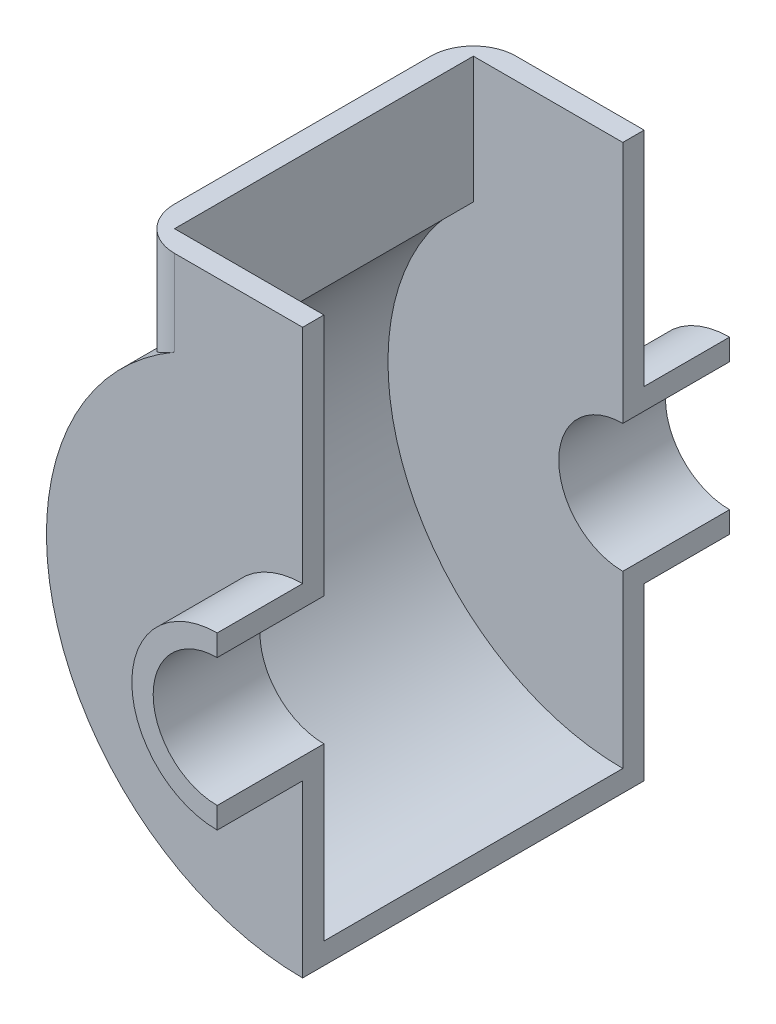
ISO-10303-21;
HEADER;
FILE_DESCRIPTION(('STEP AP214'),'2;1');
FILE_NAME('part.step','',(''),(''),'','','');
FILE_SCHEMA(('AUTOMOTIVE_DESIGN { 1 0 10303 214 1 1 1 1 }'));
ENDSEC;
DATA;
#1=APPLICATION_CONTEXT('core data for automotive mechanical design processes');
#2=APPLICATION_PROTOCOL_DEFINITION('international standard','automotive_design',2000,#1);
#3=PRODUCT_CONTEXT('',#1,'mechanical');
#4=PRODUCT('Part','Part','',(#3));
#5=PRODUCT_RELATED_PRODUCT_CATEGORY('part','',(#4));
#6=PRODUCT_DEFINITION_FORMATION('','',#4);
#7=PRODUCT_DEFINITION_CONTEXT('part definition',#1,'design');
#8=PRODUCT_DEFINITION('design','',#6,#7);
#9=PRODUCT_DEFINITION_SHAPE('','',#8);
#10=(LENGTH_UNIT() NAMED_UNIT(*) SI_UNIT(.MILLI.,.METRE.));
#11=(NAMED_UNIT(*) PLANE_ANGLE_UNIT() SI_UNIT($,.RADIAN.));
#12=(NAMED_UNIT(*) SI_UNIT($,.STERADIAN.) SOLID_ANGLE_UNIT());
#13=UNCERTAINTY_MEASURE_WITH_UNIT(LENGTH_MEASURE(1.E-05),#10,'distance_accuracy_value','');
#14=(GEOMETRIC_REPRESENTATION_CONTEXT(3) GLOBAL_UNCERTAINTY_ASSIGNED_CONTEXT((#13)) GLOBAL_UNIT_ASSIGNED_CONTEXT((#10,
#11,#12)) REPRESENTATION_CONTEXT('',''));
#15=CARTESIAN_POINT('',(0.,0.,0.));
#16=DIRECTION('',(0.,0.,1.));
#17=DIRECTION('',(1.,0.,0.));
#18=AXIS2_PLACEMENT_3D('',#15,#16,#17);
#19=CARTESIAN_POINT('',(0.,0.,0.));
#20=DIRECTION('',(0.,0.,1.));
#21=DIRECTION('',(1.,0.,0.));
#22=AXIS2_PLACEMENT_3D('',#19,#20,#21);
#23=PLANE('',#22);
#24=CARTESIAN_POINT('',(0.,0.,0.));
#25=DIRECTION('',(0.,0.,1.));
#26=DIRECTION('',(1.,0.,0.));
#27=AXIS2_PLACEMENT_3D('',#24,#25,#26);
#28=CIRCLE('',#27,55.);
#29=CARTESIAN_POINT('',(-35.,42.4264068711929,0.));
#30=VERTEX_POINT('',#29);
#31=CARTESIAN_POINT('',(0.,-55.,0.));
#32=VERTEX_POINT('',#31);
#33=EDGE_CURVE('E227',#30,#32,#28,.T.);
#34=ORIENTED_EDGE('',*,*,#33,.F.);
#35=DIRECTION('',(0.,-1.,0.));
#36=VECTOR('',#35,1.);
#37=CARTESIAN_POINT('',(-35.,72.,0.));
#38=LINE('',#37,#36);
#39=CARTESIAN_POINT('',(-35.,72.,0.));
#40=VERTEX_POINT('',#39);
#41=EDGE_CURVE('E231',#40,#30,#38,.T.);
#42=ORIENTED_EDGE('',*,*,#41,.F.);
#43=DIRECTION('',(-1.,0.,0.));
#44=VECTOR('',#43,1.);
#45=CARTESIAN_POINT('',(0.,72.,0.));
#46=LINE('',#45,#44);
#47=CARTESIAN_POINT('',(0.,72.,0.));
#48=VERTEX_POINT('',#47);
#49=EDGE_CURVE('E230',#48,#40,#46,.T.);
#50=ORIENTED_EDGE('',*,*,#49,.F.);
#51=DIRECTION('',(0.,1.,0.));
#52=VECTOR('',#51,1.);
#53=CARTESIAN_POINT('',(0.,20.,0.));
#54=LINE('',#53,#52);
#55=CARTESIAN_POINT('',(0.,15.,0.));
#56=VERTEX_POINT('',#55);
#57=EDGE_CURVE('E286',#56,#48,#54,.T.);
#58=ORIENTED_EDGE('',*,*,#57,.F.);
#59=CARTESIAN_POINT('',(0.,0.,0.));
#60=DIRECTION('',(0.,0.,-1.));
#61=DIRECTION('',(1.,0.,0.));
#62=AXIS2_PLACEMENT_3D('',#59,#60,#61);
#63=CIRCLE('',#62,15.);
#64=CARTESIAN_POINT('',(0.,-15.,0.));
#65=VERTEX_POINT('',#64);
#66=EDGE_CURVE('E272',#65,#56,#63,.T.);
#67=ORIENTED_EDGE('',*,*,#66,.F.);
#68=DIRECTION('',(0.,1.,0.));
#69=VECTOR('',#68,1.);
#70=CARTESIAN_POINT('',(0.,-15.,0.));
#71=LINE('',#70,#69);
#72=EDGE_CURVE('E277',#32,#65,#71,.T.);
#73=ORIENTED_EDGE('',*,*,#72,.F.);
#74=EDGE_LOOP('',(#34,#42,#50,#58,#67,#73));
#75=FACE_BOUND('',#74,.T.);
#76=ADVANCED_FACE('F33',(#75),#23,.F.);
#77=CARTESIAN_POINT('',(0.,0.,25.));
#78=DIRECTION('',(0.,0.,-1.));
#79=DIRECTION('',(-1.,0.,0.));
#80=AXIS2_PLACEMENT_3D('',#77,#78,#79);
#81=CYLINDRICAL_SURFACE('',#80,15.);
#82=ORIENTED_EDGE('',*,*,#66,.T.);
#83=DIRECTION('',(0.,0.,-1.));
#84=VECTOR('',#83,1.);
#85=CARTESIAN_POINT('',(0.,15.,25.));
#86=LINE('',#85,#84);
#87=CARTESIAN_POINT('',(0.,15.,25.));
#88=VERTEX_POINT('',#87);
#89=EDGE_CURVE('E296',#88,#56,#86,.T.);
#90=ORIENTED_EDGE('',*,*,#89,.F.);
#91=CARTESIAN_POINT('',(0.,0.,25.));
#92=DIRECTION('',(0.,0.,-1.));
#93=DIRECTION('',(1.,0.,0.));
#94=AXIS2_PLACEMENT_3D('',#91,#92,#93);
#95=CIRCLE('',#94,15.);
#96=CARTESIAN_POINT('',(0.,-15.,25.));
#97=VERTEX_POINT('',#96);
#98=EDGE_CURVE('E273',#97,#88,#95,.T.);
#99=ORIENTED_EDGE('',*,*,#98,.F.);
#100=DIRECTION('',(0.,0.,-1.));
#101=VECTOR('',#100,1.);
#102=CARTESIAN_POINT('',(0.,-15.,25.));
#103=LINE('',#102,#101);
#104=EDGE_CURVE('E283',#97,#65,#103,.T.);
#105=ORIENTED_EDGE('',*,*,#104,.T.);
#106=EDGE_LOOP('',(#82,#90,#99,#105));
#107=FACE_BOUND('',#106,.T.);
#108=ADVANCED_FACE('F324',(#107),#81,.F.);
#109=CARTESIAN_POINT('',(0.,20.,25.));
#110=DIRECTION('',(-1.,0.,0.));
#111=DIRECTION('',(0.,0.,1.));
#112=AXIS2_PLACEMENT_3D('',#109,#110,#111);
#113=PLANE('',#112);
#114=ORIENTED_EDGE('',*,*,#57,.T.);
#115=DIRECTION('',(0.,0.,-1.));
#116=VECTOR('',#115,1.);
#117=CARTESIAN_POINT('',(0.,72.,5.));
#118=LINE('',#117,#116);
#119=CARTESIAN_POINT('',(0.,72.,5.));
#120=VERTEX_POINT('',#119);
#121=EDGE_CURVE('E269',#120,#48,#118,.T.);
#122=ORIENTED_EDGE('',*,*,#121,.F.);
#123=DIRECTION('',(0.,1.,0.));
#124=VECTOR('',#123,1.);
#125=CARTESIAN_POINT('',(0.,20.,5.));
#126=LINE('',#125,#124);
#127=CARTESIAN_POINT('',(0.,20.,5.));
#128=VERTEX_POINT('',#127);
#129=EDGE_CURVE('E251',#128,#120,#126,.T.);
#130=ORIENTED_EDGE('',*,*,#129,.F.);
#131=DIRECTION('',(0.,0.,-1.));
#132=VECTOR('',#131,1.);
#133=CARTESIAN_POINT('',(0.,20.,25.));
#134=LINE('',#133,#132);
#135=CARTESIAN_POINT('',(0.,20.,25.));
#136=VERTEX_POINT('',#135);
#137=EDGE_CURVE('E294',#136,#128,#134,.T.);
#138=ORIENTED_EDGE('',*,*,#137,.F.);
#139=DIRECTION('',(0.,1.,0.));
#140=VECTOR('',#139,1.);
#141=CARTESIAN_POINT('',(0.,20.,25.));
#142=LINE('',#141,#140);
#143=EDGE_CURVE('E276',#88,#136,#142,.T.);
#144=ORIENTED_EDGE('',*,*,#143,.F.);
#145=ORIENTED_EDGE('',*,*,#89,.T.);
#146=EDGE_LOOP('',(#114,#122,#130,#138,#144,#145));
#147=FACE_BOUND('',#146,.T.);
#148=ADVANCED_FACE('F327',(#147),#113,.F.);
#149=CARTESIAN_POINT('',(0.,0.,25.));
#150=DIRECTION('',(0.,0.,-1.));
#151=DIRECTION('',(-1.,0.,0.));
#152=AXIS2_PLACEMENT_3D('',#149,#150,#151);
#153=CYLINDRICAL_SURFACE('',#152,20.);
#154=ORIENTED_EDGE('',*,*,#137,.T.);
#155=CARTESIAN_POINT('',(0.,0.,5.));
#156=DIRECTION('',(0.,0.,-1.));
#157=DIRECTION('',(1.,0.,0.));
#158=AXIS2_PLACEMENT_3D('',#155,#156,#157);
#159=CIRCLE('',#158,20.);
#160=CARTESIAN_POINT('',(0.,-20.,5.));
#161=VERTEX_POINT('',#160);
#162=EDGE_CURVE('E248',#161,#128,#159,.T.);
#163=ORIENTED_EDGE('',*,*,#162,.F.);
#164=DIRECTION('',(0.,0.,-1.));
#165=VECTOR('',#164,1.);
#166=CARTESIAN_POINT('',(0.,-20.,25.));
#167=LINE('',#166,#165);
#168=CARTESIAN_POINT('',(0.,-20.,25.));
#169=VERTEX_POINT('',#168);
#170=EDGE_CURVE('E291',#169,#161,#167,.T.);
#171=ORIENTED_EDGE('',*,*,#170,.F.);
#172=CARTESIAN_POINT('',(0.,0.,25.));
#173=DIRECTION('',(0.,0.,1.));
#174=DIRECTION('',(-1.,0.,0.));
#175=AXIS2_PLACEMENT_3D('',#172,#173,#174);
#176=CIRCLE('',#175,20.);
#177=EDGE_CURVE('E279',#136,#169,#176,.T.);
#178=ORIENTED_EDGE('',*,*,#177,.F.);
#179=EDGE_LOOP('',(#154,#163,#171,#178));
#180=FACE_BOUND('',#179,.T.);
#181=ADVANCED_FACE('F331',(#180),#153,.T.);
#182=CARTESIAN_POINT('',(0.,-15.,25.));
#183=DIRECTION('',(-1.,0.,0.));
#184=DIRECTION('',(0.,0.,1.));
#185=AXIS2_PLACEMENT_3D('',#182,#183,#184);
#186=PLANE('',#185);
#187=DIRECTION('',(0.,0.,-1.));
#188=VECTOR('',#187,1.);
#189=CARTESIAN_POINT('',(0.,-60.,5.));
#190=LINE('',#189,#188);
#191=CARTESIAN_POINT('',(0.,-60.,5.));
#192=VERTEX_POINT('',#191);
#193=CARTESIAN_POINT('',(0.,-60.,-75.));
#194=VERTEX_POINT('',#193);
#195=EDGE_CURVE('E259',#192,#194,#190,.T.);
#196=ORIENTED_EDGE('',*,*,#195,.T.);
#197=DIRECTION('',(0.,1.,0.));
#198=VECTOR('',#197,1.);
#199=CARTESIAN_POINT('',(0.,-60.,-75.));
#200=LINE('',#199,#198);
#201=CARTESIAN_POINT('',(0.,-20.,-75.));
#202=VERTEX_POINT('',#201);
#203=EDGE_CURVE('E186',#194,#202,#200,.T.);
#204=ORIENTED_EDGE('',*,*,#203,.T.);
#205=DIRECTION('',(0.,0.,1.));
#206=VECTOR('',#205,1.);
#207=CARTESIAN_POINT('',(0.,-20.,-95.));
#208=LINE('',#207,#206);
#209=CARTESIAN_POINT('',(0.,-20.,-95.));
#210=VERTEX_POINT('',#209);
#211=EDGE_CURVE('E219',#210,#202,#208,.T.);
#212=ORIENTED_EDGE('',*,*,#211,.F.);
#213=DIRECTION('',(0.,1.,0.));
#214=VECTOR('',#213,1.);
#215=CARTESIAN_POINT('',(0.,-15.,-95.));
#216=LINE('',#215,#214);
#217=CARTESIAN_POINT('',(0.,-15.,-95.));
#218=VERTEX_POINT('',#217);
#219=EDGE_CURVE('E209',#210,#218,#216,.T.);
#220=ORIENTED_EDGE('',*,*,#219,.T.);
#221=DIRECTION('',(0.,0.,1.));
#222=VECTOR('',#221,1.);
#223=CARTESIAN_POINT('',(0.,-15.,-95.));
#224=LINE('',#223,#222);
#225=CARTESIAN_POINT('',(0.,-15.,-70.));
#226=VERTEX_POINT('',#225);
#227=EDGE_CURVE('E211',#218,#226,#224,.T.);
#228=ORIENTED_EDGE('',*,*,#227,.T.);
#229=DIRECTION('',(0.,1.,0.));
#230=VECTOR('',#229,1.);
#231=CARTESIAN_POINT('',(0.,-15.,-70.));
#232=LINE('',#231,#230);
#233=CARTESIAN_POINT('',(0.,-55.,-70.));
#234=VERTEX_POINT('',#233);
#235=EDGE_CURVE('E204',#234,#226,#232,.T.);
#236=ORIENTED_EDGE('',*,*,#235,.F.);
#237=DIRECTION('',(0.,0.,1.));
#238=VECTOR('',#237,1.);
#239=CARTESIAN_POINT('',(0.,-55.,-95.002));
#240=LINE('',#239,#238);
#241=EDGE_CURVE('E235',#234,#32,#240,.T.);
#242=ORIENTED_EDGE('',*,*,#241,.T.);
#243=ORIENTED_EDGE('',*,*,#72,.T.);
#244=ORIENTED_EDGE('',*,*,#104,.F.);
#245=DIRECTION('',(0.,1.,0.));
#246=VECTOR('',#245,1.);
#247=CARTESIAN_POINT('',(0.,-15.,25.));
#248=LINE('',#247,#246);
#249=EDGE_CURVE('E281',#169,#97,#248,.T.);
#250=ORIENTED_EDGE('',*,*,#249,.F.);
#251=ORIENTED_EDGE('',*,*,#170,.T.);
#252=DIRECTION('',(0.,1.,0.));
#253=VECTOR('',#252,1.);
#254=CARTESIAN_POINT('',(0.,-60.,5.));
#255=LINE('',#254,#253);
#256=EDGE_CURVE('E256',#192,#161,#255,.T.);
#257=ORIENTED_EDGE('',*,*,#256,.F.);
#258=EDGE_LOOP('',(#196,#204,#212,#220,#228,#236,#242,#243,#244,#250,#251,#257));
#259=FACE_BOUND('',#258,.T.);
#260=ADVANCED_FACE('F335',(#259),#186,.F.);
#261=CARTESIAN_POINT('',(0.,0.,25.));
#262=DIRECTION('',(0.,0.,1.));
#263=DIRECTION('',(1.,0.,0.));
#264=AXIS2_PLACEMENT_3D('',#261,#262,#263);
#265=PLANE('',#264);
#266=ORIENTED_EDGE('',*,*,#98,.T.);
#267=ORIENTED_EDGE('',*,*,#143,.T.);
#268=ORIENTED_EDGE('',*,*,#177,.T.);
#269=ORIENTED_EDGE('',*,*,#249,.T.);
#270=EDGE_LOOP('',(#266,#267,#268,#269));
#271=FACE_BOUND('',#270,.T.);
#272=ADVANCED_FACE('F339',(#271),#265,.T.);
#273=CARTESIAN_POINT('',(0.,72.,5.));
#274=DIRECTION('',(0.,-1.,0.));
#275=DIRECTION('',(0.,0.,-1.));
#276=AXIS2_PLACEMENT_3D('',#273,#274,#275);
#277=PLANE('',#276);
#278=DIRECTION('',(-1.,0.,0.));
#279=VECTOR('',#278,1.);
#280=CARTESIAN_POINT('',(0.,72.,-75.));
#281=LINE('',#280,#279);
#282=CARTESIAN_POINT('',(0.,72.,-75.));
#283=VERTEX_POINT('',#282);
#284=CARTESIAN_POINT('',(-30.,72.,-75.));
#285=VERTEX_POINT('',#284);
#286=EDGE_CURVE('E165',#283,#285,#281,.T.);
#287=ORIENTED_EDGE('',*,*,#286,.T.);
#288=CARTESIAN_POINT('',(-30.,72.,-65.));
#289=DIRECTION('',(0.,-1.,0.));
#290=DIRECTION('',(0.,0.,-1.));
#291=AXIS2_PLACEMENT_3D('',#288,#289,#290);
#292=CIRCLE('',#291,10.);
#293=CARTESIAN_POINT('',(-40.,72.,-65.));
#294=VERTEX_POINT('',#293);
#295=EDGE_CURVE('E306',#285,#294,#292,.F.);
#296=ORIENTED_EDGE('',*,*,#295,.T.);
#297=DIRECTION('',(0.,0.,-1.));
#298=VECTOR('',#297,1.);
#299=CARTESIAN_POINT('',(-40.,72.,5.));
#300=LINE('',#299,#298);
#301=CARTESIAN_POINT('',(-40.,72.,-5.));
#302=VERTEX_POINT('',#301);
#303=EDGE_CURVE('E266',#302,#294,#300,.T.);
#304=ORIENTED_EDGE('',*,*,#303,.F.);
#305=CARTESIAN_POINT('',(-30.,72.,-5.));
#306=DIRECTION('',(0.,-1.,0.));
#307=DIRECTION('',(0.,0.,-1.));
#308=AXIS2_PLACEMENT_3D('',#305,#306,#307);
#309=CIRCLE('',#308,10.);
#310=CARTESIAN_POINT('',(-30.,72.,5.));
#311=VERTEX_POINT('',#310);
#312=EDGE_CURVE('E61',#302,#311,#309,.F.);
#313=ORIENTED_EDGE('',*,*,#312,.T.);
#314=DIRECTION('',(-1.,0.,0.));
#315=VECTOR('',#314,1.);
#316=CARTESIAN_POINT('',(0.,72.,5.));
#317=LINE('',#316,#315);
#318=EDGE_CURVE('E253',#120,#311,#317,.T.);
#319=ORIENTED_EDGE('',*,*,#318,.F.);
#320=ORIENTED_EDGE('',*,*,#121,.T.);
#321=ORIENTED_EDGE('',*,*,#49,.T.);
#322=DIRECTION('',(0.,0.,1.));
#323=VECTOR('',#322,1.);
#324=CARTESIAN_POINT('',(-35.,72.,-95.002));
#325=LINE('',#324,#323);
#326=CARTESIAN_POINT('',(-35.,72.,-70.));
#327=VERTEX_POINT('',#326);
#328=EDGE_CURVE('E234',#327,#40,#325,.T.);
#329=ORIENTED_EDGE('',*,*,#328,.F.);
#330=DIRECTION('',(-1.,0.,0.));
#331=VECTOR('',#330,1.);
#332=CARTESIAN_POINT('',(0.,72.,-70.));
#333=LINE('',#332,#331);
#334=CARTESIAN_POINT('',(0.,72.,-70.));
#335=VERTEX_POINT('',#334);
#336=EDGE_CURVE('E182',#335,#327,#333,.T.);
#337=ORIENTED_EDGE('',*,*,#336,.F.);
#338=DIRECTION('',(0.,0.,1.));
#339=VECTOR('',#338,1.);
#340=CARTESIAN_POINT('',(0.,72.,-75.));
#341=LINE('',#340,#339);
#342=EDGE_CURVE('E178',#283,#335,#341,.T.);
#343=ORIENTED_EDGE('',*,*,#342,.F.);
#344=EDGE_LOOP('',(#287,#296,#304,#313,#319,#320,#321,#329,#337,#343));
#345=FACE_BOUND('',#344,.T.);
#346=ADVANCED_FACE('F179',(#345),#277,.F.);
#347=CARTESIAN_POINT('',(-40.,72.,5.));
#348=DIRECTION('',(1.,0.,0.));
#349=DIRECTION('',(0.,1.,0.));
#350=AXIS2_PLACEMENT_3D('',#347,#348,#349);
#351=PLANE('',#350);
#352=ORIENTED_EDGE('',*,*,#303,.T.);
#353=DIRECTION('',(0.,-1.,0.));
#354=VECTOR('',#353,1.);
#355=CARTESIAN_POINT('',(-40.,44.7213595499958,-65.));
#356=LINE('',#355,#354);
#357=CARTESIAN_POINT('',(-40.,44.7213595499958,-65.));
#358=VERTEX_POINT('',#357);
#359=EDGE_CURVE('E301',#294,#358,#356,.T.);
#360=ORIENTED_EDGE('',*,*,#359,.T.);
#361=DIRECTION('',(0.,0.,-1.));
#362=VECTOR('',#361,1.);
#363=CARTESIAN_POINT('',(-40.,44.7213595499958,5.));
#364=LINE('',#363,#362);
#365=CARTESIAN_POINT('',(-40.,44.7213595499958,-5.));
#366=VERTEX_POINT('',#365);
#367=EDGE_CURVE('E263',#366,#358,#364,.T.);
#368=ORIENTED_EDGE('',*,*,#367,.F.);
#369=DIRECTION('',(0.,-1.,0.));
#370=VECTOR('',#369,1.);
#371=CARTESIAN_POINT('',(-40.,72.,-5.));
#372=LINE('',#371,#370);
#373=EDGE_CURVE('E299',#366,#302,#372,.F.);
#374=ORIENTED_EDGE('',*,*,#373,.T.);
#375=EDGE_LOOP('',(#352,#360,#368,#374));
#376=FACE_BOUND('',#375,.T.);
#377=ADVANCED_FACE('F348',(#376),#351,.F.);
#378=CARTESIAN_POINT('',(0.,0.,5.));
#379=DIRECTION('',(0.,0.,-1.));
#380=DIRECTION('',(-1.,0.,0.));
#381=AXIS2_PLACEMENT_3D('',#378,#379,#380);
#382=CYLINDRICAL_SURFACE('',#381,60.);
#383=CARTESIAN_POINT('',(0.,0.,5.));
#384=DIRECTION('',(0.,0.,1.));
#385=DIRECTION('',(1.,0.,0.));
#386=AXIS2_PLACEMENT_3D('',#383,#384,#385);
#387=CIRCLE('',#386,60.);
#388=CARTESIAN_POINT('',(-30.,51.9615242270663,5.));
#389=VERTEX_POINT('',#388);
#390=EDGE_CURVE('E53',#389,#192,#387,.T.);
#391=ORIENTED_EDGE('',*,*,#390,.F.);
#392=CARTESIAN_POINT('',(-30.,51.9615242270663,5.));
#393=CARTESIAN_POINT('',(-30.1846403402756,51.8549243575685,4.99999694467445));
#394=CARTESIAN_POINT('',(-30.3686755821332,51.7473565843307,4.99488587812623));
#395=CARTESIAN_POINT('',(-30.7351668388071,51.5305231450817,4.97462918627216));
#396=CARTESIAN_POINT('',(-30.9176229894396,51.4212576273975,4.95948443281986));
#397=CARTESIAN_POINT('',(-31.4619253243051,51.0913595980358,4.89929167200636));
#398=CARTESIAN_POINT('',(-31.8209014856785,50.868512343648,4.83948477245505));
#399=CARTESIAN_POINT('',(-32.5288887310146,50.418725257113,4.6817684192746));
#400=CARTESIAN_POINT('',(-32.8778736192083,50.1917768316845,4.5837671788936));
#401=CARTESIAN_POINT('',(-33.562476910193,49.7365966241752,4.35090696893926));
#402=CARTESIAN_POINT('',(-33.8980954977703,49.5083648598862,4.21604850911225));
#403=CARTESIAN_POINT('',(-34.5207296024579,49.0759439346811,3.92574534472068));
#404=CARTESIAN_POINT('',(-34.80925125366,48.8716304811259,3.77370267176126));
#405=CARTESIAN_POINT('',(-35.3716903107987,48.4661085573826,3.44107089228342));
#406=CARTESIAN_POINT('',(-35.6456079007732,48.2649000480893,3.26048214561176));
#407=CARTESIAN_POINT('',(-36.1765727574088,47.8682074936152,2.87135112309205));
#408=CARTESIAN_POINT('',(-36.4336405194033,47.6727166603459,2.66284378257166));
#409=CARTESIAN_POINT('',(-36.9290721152615,47.2899728283631,2.21794621899144));
#410=CARTESIAN_POINT('',(-37.167441451851,47.1027174132443,1.98156425075618));
#411=CARTESIAN_POINT('',(-37.565018182153,46.7858596341651,1.54478146403292));
#412=CARTESIAN_POINT('',(-37.7289458526818,46.6537017113221,1.35050833176436));
#413=CARTESIAN_POINT('',(-38.0437650386959,46.3973395734391,0.946710505836684));
#414=CARTESIAN_POINT('',(-38.1946575996422,46.2731347207424,0.737187037795443));
#415=CARTESIAN_POINT('',(-38.4818360085843,46.0345861261904,0.303399948510734));
#416=CARTESIAN_POINT('',(-38.618136880254,45.9202322658759,0.0791518792914311));
#417=CARTESIAN_POINT('',(-38.8746918035924,45.7032445431668,-0.383743447816971));
#418=CARTESIAN_POINT('',(-38.9949492411763,45.6006082084878,-0.622387651960067));
#419=CARTESIAN_POINT('',(-39.1965662504921,45.4273417305266,-1.06669402634215));
#420=CARTESIAN_POINT('',(-39.2809795718102,45.3543309967536,-1.27004581930022));
#421=CARTESIAN_POINT('',(-39.437114382813,45.2186323209964,-1.68488791321455));
#422=CARTESIAN_POINT('',(-39.5088384943779,45.1559422467147,-1.89637652189832));
#423=CARTESIAN_POINT('',(-39.6385128100447,45.0421551914612,-2.32617263610177));
#424=CARTESIAN_POINT('',(-39.6964869139818,44.9910381018204,-2.54446755239788));
#425=CARTESIAN_POINT('',(-39.7978943535571,44.9013606141582,-2.986852666006));
#426=CARTESIAN_POINT('',(-39.8413328734581,44.8627957393971,-3.2109407663361));
#427=CARTESIAN_POINT('',(-39.9177189665931,44.7948514731766,-3.69377442824111));
#428=CARTESIAN_POINT('',(-39.9484884415043,44.7673886419263,-3.95314914513775));
#429=CARTESIAN_POINT('',(-39.9793476433001,44.7398248250479,-4.34440444684136));
#430=CARTESIAN_POINT('',(-39.9870849214509,44.7329085695169,-4.47527578752074));
#431=CARTESIAN_POINT('',(-39.997412966172,44.7236736235071,-4.73742237599204));
#432=CARTESIAN_POINT('',(-40.0000021863485,44.7213563144783,-4.86869773328783));
#433=CARTESIAN_POINT('',(-40.,44.7213595499958,-5.));
#434=B_SPLINE_CURVE_WITH_KNOTS('',3,(#392,#393,#394,#395,#396,#397,#398,#399,#400,#401,#402,
#403,#404,#405,#406,#407,#408,#409,#410,#411,#412,#413,#414,#415,#416,#417,#418,#419,#420,#421,
#422,#423,#424,#425,#426,#427,#428,#429,#430,#431,#432,#433),.UNSPECIFIED.,.F.,.F.,(4,2,2,2,2,2,
2,2,2,2,2,2,2,2,2,2,2,2,2,2,4),(0.,0.639469988122809,1.27888441829632,2.5570367234409,
3.83827975129429,5.11950506007104,6.27274736359204,7.42597513070353,8.5777730871098,
9.72923080131073,10.5879927572485,11.4466857734357,12.3044859953459,13.1621048939207,
13.8573439066469,14.5524390989254,15.2463170957639,15.9399473495783,16.7262834977137,
17.1199731890566,17.5137811205932),.UNSPECIFIED.);
#435=EDGE_CURVE('E11',#389,#366,#434,.T.);
#436=ORIENTED_EDGE('',*,*,#435,.T.);
#437=ORIENTED_EDGE('',*,*,#367,.T.);
#438=CARTESIAN_POINT('',(-40.,44.7213595499958,-65.));
#439=CARTESIAN_POINT('',(-40.0000015812733,44.7213573011345,-65.1176634010021));
#440=CARTESIAN_POINT('',(-39.9979227141807,44.7232176305845,-65.2353086549857));
#441=CARTESIAN_POINT('',(-39.9896253110865,44.7306372942272,-65.4703286016599));
#442=CARTESIAN_POINT('',(-39.9834070494192,44.7361963832882,-65.5877033117632));
#443=CARTESIAN_POINT('',(-39.9585923280534,44.7583670958172,-65.9388427467587));
#444=CARTESIAN_POINT('',(-39.9338358355778,44.7804722797486,-66.1718758054602));
#445=CARTESIAN_POINT('',(-39.8686644525486,44.8385042167555,-66.6318691326489));
#446=CARTESIAN_POINT('',(-39.8283855148164,44.8743109465834,-66.8588643223737));
#447=CARTESIAN_POINT('',(-39.732889266228,44.9588875680342,-67.3072524479117));
#448=CARTESIAN_POINT('',(-39.6776696039361,45.0076595001555,-67.5286444958756));
#449=CARTESIAN_POINT('',(-39.5534118644792,45.116897250534,-67.9636688649734));
#450=CARTESIAN_POINT('',(-39.4844211995898,45.1773229225701,-68.1773249178853));
#451=CARTESIAN_POINT('',(-39.3334605195832,45.3088170177996,-68.5966936542645));
#452=CARTESIAN_POINT('',(-39.2514857085458,45.3798893730023,-68.8024033675523));
#453=CARTESIAN_POINT('',(-39.0753863002098,45.5316122169458,-69.2054529377369));
#454=CARTESIAN_POINT('',(-38.9812363061757,45.6122826978885,-69.4027741200324));
#455=CARTESIAN_POINT('',(-38.7818943790382,45.7818938454653,-69.788046749896));
#456=CARTESIAN_POINT('',(-38.6767013504078,45.8708353325264,-69.9759972651116));
#457=CARTESIAN_POINT('',(-38.4135728743111,46.0916172160901,-70.4129070483268));
#458=CARTESIAN_POINT('',(-38.2509572804995,46.2267600621542,-70.6573967975822));
#459=CARTESIAN_POINT('',(-37.9084470364049,46.5080507377658,-71.1270697633622));
#460=CARTESIAN_POINT('',(-37.7285517130429,46.6541989959475,-71.3522522271834));
#461=CARTESIAN_POINT('',(-37.3531054007839,46.9553345195759,-71.783333742699));
#462=CARTESIAN_POINT('',(-37.1575367002327,47.1103317262239,-71.9892103913973));
#463=CARTESIAN_POINT('',(-36.7525951751676,47.4269223387039,-72.3811838692743));
#464=CARTESIAN_POINT('',(-36.5432234671629,47.5885152106185,-72.5672822951176));
#465=CARTESIAN_POINT('',(-35.8893524206259,48.0859277319981,-73.1015951815724));
#466=CARTESIAN_POINT('',(-35.4251261289152,48.4294985596681,-73.4189829871174));
#467=CARTESIAN_POINT('',(-34.4553726874119,49.1241578823888,-73.9699716496598));
#468=CARTESIAN_POINT('',(-33.9498747171002,49.4752409388269,-74.2036310842669));
#469=CARTESIAN_POINT('',(-33.1568278633414,50.0073212539566,-74.4930456878643));
#470=CARTESIAN_POINT('',(-32.8810021018504,50.1891501210001,-74.5803819665683));
#471=CARTESIAN_POINT('',(-32.3217375725054,50.5511235483305,-74.7310524671282));
#472=CARTESIAN_POINT('',(-32.038299178087,50.7312681906543,-74.7943878640467));
#473=CARTESIAN_POINT('',(-31.4650006560554,51.0888227050654,-74.8963939978526));
#474=CARTESIAN_POINT('',(-31.1751356203563,51.2662302982853,-74.935045161166));
#475=CARTESIAN_POINT('',(-30.5906934832528,51.6171131325133,-74.9868485137105));
#476=CARTESIAN_POINT('',(-30.2961152167169,51.7905873747387,-74.9999942965489));
#477=CARTESIAN_POINT('',(-30.,51.9615242270663,-75.));
#478=B_SPLINE_CURVE_WITH_KNOTS('',3,(#438,#439,#440,#441,#442,#443,#444,#445,#446,#447,#448,
#449,#450,#451,#452,#453,#454,#455,#456,#457,#458,#459,#460,#461,#462,#463,#464,#465,#466,#467,
#468,#469,#470,#471,#472,#473,#474,#475,#476,#477),.UNSPECIFIED.,.F.,.F.,(4,2,2,2,2,2,2,2,2,2,2,
2,2,2,2,2,2,2,2,4),(0.,0.352921378883185,0.705819370583172,1.41085932128629,2.10985961734753,
2.80896998914977,3.50571366437716,4.20271529673452,4.9011950223396,5.59974410640155,
6.56805788163331,7.536409389878,8.50587104319845,9.47525437387455,11.4447404103531,
13.4128458625583,14.4372042618812,15.4615125030147,16.4866319729198,17.5120088970541),.UNSPECIFIED.);
#479=CARTESIAN_POINT('',(-30.,51.9615242270663,-75.));
#480=VERTEX_POINT('',#479);
#481=EDGE_CURVE('E47',#358,#480,#478,.T.);
#482=ORIENTED_EDGE('',*,*,#481,.T.);
#483=CARTESIAN_POINT('',(0.,0.,-75.));
#484=DIRECTION('',(0.,0.,1.));
#485=DIRECTION('',(1.,0.,0.));
#486=AXIS2_PLACEMENT_3D('',#483,#484,#485);
#487=CIRCLE('',#486,60.);
#488=EDGE_CURVE('E175',#480,#194,#487,.T.);
#489=ORIENTED_EDGE('',*,*,#488,.T.);
#490=ORIENTED_EDGE('',*,*,#195,.F.);
#491=EDGE_LOOP('',(#391,#436,#437,#482,#489,#490));
#492=FACE_BOUND('',#491,.T.);
#493=ADVANCED_FACE('F315',(#492),#382,.T.);
#494=CARTESIAN_POINT('',(0.,0.,5.));
#495=DIRECTION('',(0.,0.,1.));
#496=DIRECTION('',(1.,0.,0.));
#497=AXIS2_PLACEMENT_3D('',#494,#495,#496);
#498=PLANE('',#497);
#499=ORIENTED_EDGE('',*,*,#318,.T.);
#500=DIRECTION('',(0.,-1.,0.));
#501=VECTOR('',#500,1.);
#502=CARTESIAN_POINT('',(-30.,44.7213595499958,5.));
#503=LINE('',#502,#501);
#504=EDGE_CURVE('E308',#311,#389,#503,.T.);
#505=ORIENTED_EDGE('',*,*,#504,.T.);
#506=ORIENTED_EDGE('',*,*,#390,.T.);
#507=ORIENTED_EDGE('',*,*,#256,.T.);
#508=ORIENTED_EDGE('',*,*,#162,.T.);
#509=ORIENTED_EDGE('',*,*,#129,.T.);
#510=EDGE_LOOP('',(#499,#505,#506,#507,#508,#509));
#511=FACE_BOUND('',#510,.T.);
#512=ADVANCED_FACE('F354',(#511),#498,.T.);
#513=CARTESIAN_POINT('',(0.,0.,-95.002));
#514=DIRECTION('',(0.,0.,1.));
#515=DIRECTION('',(1.,0.,0.));
#516=AXIS2_PLACEMENT_3D('',#513,#514,#515);
#517=CYLINDRICAL_SURFACE('',#516,55.);
#518=CARTESIAN_POINT('',(0.,0.,-70.));
#519=DIRECTION('',(0.,0.,-1.));
#520=DIRECTION('',(-1.,0.,0.));
#521=AXIS2_PLACEMENT_3D('',#518,#519,#520);
#522=CIRCLE('',#521,55.);
#523=CARTESIAN_POINT('',(-35.,42.4264068711929,-70.));
#524=VERTEX_POINT('',#523);
#525=EDGE_CURVE('E239',#524,#234,#522,.F.);
#526=ORIENTED_EDGE('',*,*,#525,.F.);
#527=DIRECTION('',(0.,0.,1.));
#528=VECTOR('',#527,1.);
#529=CARTESIAN_POINT('',(-35.,42.4264068711929,-95.002));
#530=LINE('',#529,#528);
#531=EDGE_CURVE('E238',#524,#30,#530,.T.);
#532=ORIENTED_EDGE('',*,*,#531,.T.);
#533=ORIENTED_EDGE('',*,*,#33,.T.);
#534=ORIENTED_EDGE('',*,*,#241,.F.);
#535=EDGE_LOOP('',(#526,#532,#533,#534));
#536=FACE_BOUND('',#535,.T.);
#537=ADVANCED_FACE('F392',(#536),#517,.F.);
#538=CARTESIAN_POINT('',(-35.,72.,-95.002));
#539=DIRECTION('',(-1.,0.,0.));
#540=DIRECTION('',(0.,-1.,0.));
#541=AXIS2_PLACEMENT_3D('',#538,#539,#540);
#542=PLANE('',#541);
#543=DIRECTION('',(0.,-1.,0.));
#544=VECTOR('',#543,1.);
#545=CARTESIAN_POINT('',(-35.,72.,-70.));
#546=LINE('',#545,#544);
#547=EDGE_CURVE('E226',#327,#524,#546,.T.);
#548=ORIENTED_EDGE('',*,*,#547,.F.);
#549=ORIENTED_EDGE('',*,*,#328,.T.);
#550=ORIENTED_EDGE('',*,*,#41,.T.);
#551=ORIENTED_EDGE('',*,*,#531,.F.);
#552=EDGE_LOOP('',(#548,#549,#550,#551));
#553=FACE_BOUND('',#552,.T.);
#554=ADVANCED_FACE('F367',(#553),#542,.F.);
#555=CARTESIAN_POINT('',(0.,0.,-70.));
#556=DIRECTION('',(0.,0.,-1.));
#557=DIRECTION('',(1.,0.,0.));
#558=AXIS2_PLACEMENT_3D('',#555,#556,#557);
#559=PLANE('',#558);
#560=ORIENTED_EDGE('',*,*,#547,.T.);
#561=ORIENTED_EDGE('',*,*,#525,.T.);
#562=ORIENTED_EDGE('',*,*,#235,.T.);
#563=CARTESIAN_POINT('',(0.,0.,-70.));
#564=DIRECTION('',(0.,0.,-1.));
#565=DIRECTION('',(1.,0.,0.));
#566=AXIS2_PLACEMENT_3D('',#563,#564,#565);
#567=CIRCLE('',#566,15.);
#568=CARTESIAN_POINT('',(0.,15.,-70.));
#569=VERTEX_POINT('',#568);
#570=EDGE_CURVE('E185',#226,#569,#567,.T.);
#571=ORIENTED_EDGE('',*,*,#570,.T.);
#572=DIRECTION('',(0.,1.,0.));
#573=VECTOR('',#572,1.);
#574=CARTESIAN_POINT('',(0.,20.,-70.));
#575=LINE('',#574,#573);
#576=EDGE_CURVE('E214',#569,#335,#575,.T.);
#577=ORIENTED_EDGE('',*,*,#576,.T.);
#578=ORIENTED_EDGE('',*,*,#336,.T.);
#579=EDGE_LOOP('',(#560,#561,#562,#571,#577,#578));
#580=FACE_BOUND('',#579,.T.);
#581=ADVANCED_FACE('F370',(#580),#559,.F.);
#582=CARTESIAN_POINT('',(0.,0.,-95.));
#583=DIRECTION('',(0.,0.,1.));
#584=DIRECTION('',(-1.,0.,0.));
#585=AXIS2_PLACEMENT_3D('',#582,#583,#584);
#586=CYLINDRICAL_SURFACE('',#585,15.);
#587=ORIENTED_EDGE('',*,*,#570,.F.);
#588=ORIENTED_EDGE('',*,*,#227,.F.);
#589=CARTESIAN_POINT('',(0.,0.,-95.));
#590=DIRECTION('',(0.,0.,-1.));
#591=DIRECTION('',(1.,0.,0.));
#592=AXIS2_PLACEMENT_3D('',#589,#590,#591);
#593=CIRCLE('',#592,15.);
#594=CARTESIAN_POINT('',(0.,15.,-95.));
#595=VERTEX_POINT('',#594);
#596=EDGE_CURVE('E200',#218,#595,#593,.T.);
#597=ORIENTED_EDGE('',*,*,#596,.T.);
#598=DIRECTION('',(0.,0.,1.));
#599=VECTOR('',#598,1.);
#600=CARTESIAN_POINT('',(0.,15.,-95.));
#601=LINE('',#600,#599);
#602=EDGE_CURVE('E223',#595,#569,#601,.T.);
#603=ORIENTED_EDGE('',*,*,#602,.T.);
#604=EDGE_LOOP('',(#587,#588,#597,#603));
#605=FACE_BOUND('',#604,.T.);
#606=ADVANCED_FACE('F374',(#605),#586,.F.);
#607=CARTESIAN_POINT('',(0.,20.,-95.));
#608=DIRECTION('',(-1.,0.,0.));
#609=DIRECTION('',(0.,0.,-1.));
#610=AXIS2_PLACEMENT_3D('',#607,#608,#609);
#611=PLANE('',#610);
#612=ORIENTED_EDGE('',*,*,#576,.F.);
#613=ORIENTED_EDGE('',*,*,#602,.F.);
#614=DIRECTION('',(0.,1.,0.));
#615=VECTOR('',#614,1.);
#616=CARTESIAN_POINT('',(0.,20.,-95.));
#617=LINE('',#616,#615);
#618=CARTESIAN_POINT('',(0.,20.,-95.));
#619=VERTEX_POINT('',#618);
#620=EDGE_CURVE('E203',#595,#619,#617,.T.);
#621=ORIENTED_EDGE('',*,*,#620,.T.);
#622=DIRECTION('',(0.,0.,1.));
#623=VECTOR('',#622,1.);
#624=CARTESIAN_POINT('',(0.,20.,-95.));
#625=LINE('',#624,#623);
#626=CARTESIAN_POINT('',(0.,20.,-75.));
#627=VERTEX_POINT('',#626);
#628=EDGE_CURVE('E191',#619,#627,#625,.T.);
#629=ORIENTED_EDGE('',*,*,#628,.T.);
#630=DIRECTION('',(0.,1.,0.));
#631=VECTOR('',#630,1.);
#632=CARTESIAN_POINT('',(0.,20.,-75.));
#633=LINE('',#632,#631);
#634=EDGE_CURVE('E170',#627,#283,#633,.T.);
#635=ORIENTED_EDGE('',*,*,#634,.T.);
#636=ORIENTED_EDGE('',*,*,#342,.T.);
#637=EDGE_LOOP('',(#612,#613,#621,#629,#635,#636));
#638=FACE_BOUND('',#637,.T.);
#639=ADVANCED_FACE('F188',(#638),#611,.F.);
#640=CARTESIAN_POINT('',(0.,0.,-95.));
#641=DIRECTION('',(0.,0.,1.));
#642=DIRECTION('',(-1.,0.,0.));
#643=AXIS2_PLACEMENT_3D('',#640,#641,#642);
#644=CYLINDRICAL_SURFACE('',#643,20.);
#645=ORIENTED_EDGE('',*,*,#628,.F.);
#646=CARTESIAN_POINT('',(0.,0.,-95.));
#647=DIRECTION('',(0.,0.,1.));
#648=DIRECTION('',(-1.,0.,0.));
#649=AXIS2_PLACEMENT_3D('',#646,#647,#648);
#650=CIRCLE('',#649,20.);
#651=EDGE_CURVE('E206',#619,#210,#650,.T.);
#652=ORIENTED_EDGE('',*,*,#651,.T.);
#653=ORIENTED_EDGE('',*,*,#211,.T.);
#654=CARTESIAN_POINT('',(0.,0.,-75.));
#655=DIRECTION('',(0.,0.,-1.));
#656=DIRECTION('',(1.,0.,0.));
#657=AXIS2_PLACEMENT_3D('',#654,#655,#656);
#658=CIRCLE('',#657,20.);
#659=EDGE_CURVE('E192',#202,#627,#658,.T.);
#660=ORIENTED_EDGE('',*,*,#659,.T.);
#661=EDGE_LOOP('',(#645,#652,#653,#660));
#662=FACE_BOUND('',#661,.T.);
#663=ADVANCED_FACE('F381',(#662),#644,.T.);
#664=CARTESIAN_POINT('',(0.,0.,-95.));
#665=DIRECTION('',(0.,0.,-1.));
#666=DIRECTION('',(1.,0.,0.));
#667=AXIS2_PLACEMENT_3D('',#664,#665,#666);
#668=PLANE('',#667);
#669=ORIENTED_EDGE('',*,*,#596,.F.);
#670=ORIENTED_EDGE('',*,*,#219,.F.);
#671=ORIENTED_EDGE('',*,*,#651,.F.);
#672=ORIENTED_EDGE('',*,*,#620,.F.);
#673=EDGE_LOOP('',(#669,#670,#671,#672));
#674=FACE_BOUND('',#673,.T.);
#675=ADVANCED_FACE('F378',(#674),#668,.T.);
#676=CARTESIAN_POINT('',(0.,0.,-75.));
#677=DIRECTION('',(0.,0.,-1.));
#678=DIRECTION('',(1.,0.,0.));
#679=AXIS2_PLACEMENT_3D('',#676,#677,#678);
#680=PLANE('',#679);
#681=ORIENTED_EDGE('',*,*,#488,.F.);
#682=DIRECTION('',(0.,-1.,0.));
#683=VECTOR('',#682,1.);
#684=CARTESIAN_POINT('',(-30.,72.,-75.));
#685=LINE('',#684,#683);
#686=EDGE_CURVE('E173',#480,#285,#685,.F.);
#687=ORIENTED_EDGE('',*,*,#686,.T.);
#688=ORIENTED_EDGE('',*,*,#286,.F.);
#689=ORIENTED_EDGE('',*,*,#634,.F.);
#690=ORIENTED_EDGE('',*,*,#659,.F.);
#691=ORIENTED_EDGE('',*,*,#203,.F.);
#692=EDGE_LOOP('',(#681,#687,#688,#689,#690,#691));
#693=FACE_BOUND('',#692,.T.);
#694=ADVANCED_FACE('F167',(#693),#680,.T.);
#695=CARTESIAN_POINT('',(-30.,72.,-65.));
#696=DIRECTION('',(0.,1.,0.));
#697=DIRECTION('',(-1.,0.,0.));
#698=AXIS2_PLACEMENT_3D('',#695,#696,#697);
#699=CYLINDRICAL_SURFACE('',#698,10.);
#700=ORIENTED_EDGE('',*,*,#295,.F.);
#701=ORIENTED_EDGE('',*,*,#686,.F.);
#702=ORIENTED_EDGE('',*,*,#481,.F.);
#703=ORIENTED_EDGE('',*,*,#359,.F.);
#704=EDGE_LOOP('',(#700,#701,#702,#703));
#705=FACE_BOUND('',#704,.T.);
#706=ADVANCED_FACE('F319',(#705),#699,.T.);
#707=CARTESIAN_POINT('',(-29.9999999999999,0.,-5.));
#708=DIRECTION('',(0.,1.,0.));
#709=DIRECTION('',(-1.,0.,0.));
#710=AXIS2_PLACEMENT_3D('',#707,#708,#709);
#711=CYLINDRICAL_SURFACE('',#710,10.);
#712=ORIENTED_EDGE('',*,*,#312,.F.);
#713=ORIENTED_EDGE('',*,*,#373,.F.);
#714=ORIENTED_EDGE('',*,*,#435,.F.);
#715=ORIENTED_EDGE('',*,*,#504,.F.);
#716=EDGE_LOOP('',(#712,#713,#714,#715));
#717=FACE_BOUND('',#716,.T.);
#718=ADVANCED_FACE('F35',(#717),#711,.T.);
#719=CLOSED_SHELL('',(#76,#108,#148,#181,#260,#272,#346,#377,#493,#512,#537,#554,#581,#606,#639,
#663,#675,#694,#706,#718));
#720=MANIFOLD_SOLID_BREP('B2',#719);
#721=ADVANCED_BREP_SHAPE_REPRESENTATION('',(#18,#720),#14);
#722=SHAPE_DEFINITION_REPRESENTATION(#9,#721);
ENDSEC;
END-ISO-10303-21;
